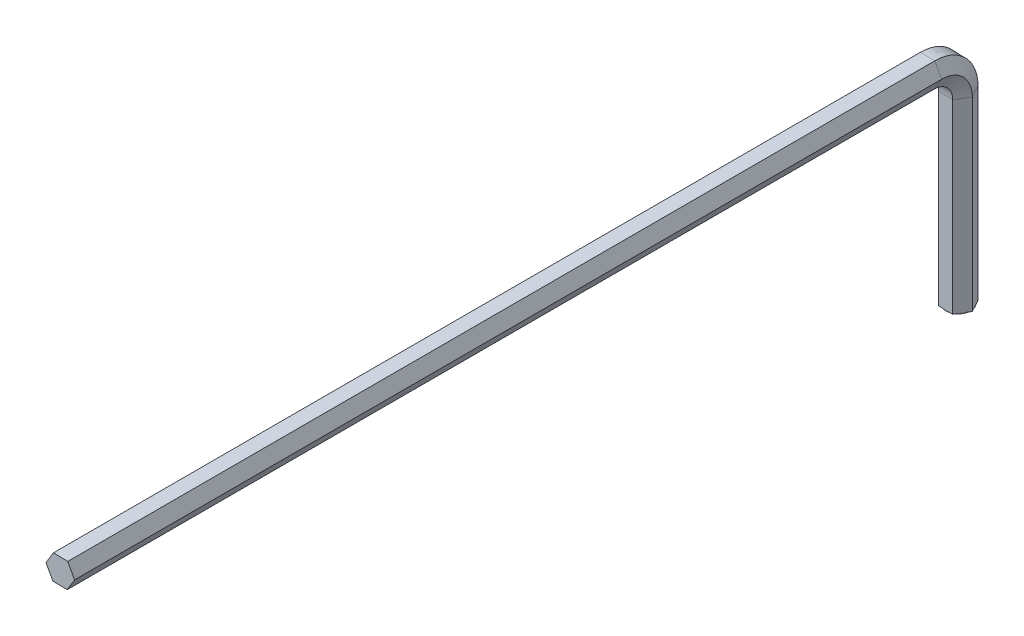
ISO-10303-21;
HEADER;
FILE_DESCRIPTION(('STEP AP214'),'2;1');
FILE_NAME('part.step','',(''),(''),'','','');
FILE_SCHEMA(('AUTOMOTIVE_DESIGN { 1 0 10303 214 1 1 1 1 }'));
ENDSEC;
DATA;
#1=APPLICATION_CONTEXT('core data for automotive mechanical design processes');
#2=APPLICATION_PROTOCOL_DEFINITION('international standard','automotive_design',2000,#1);
#3=PRODUCT_CONTEXT('',#1,'mechanical');
#4=PRODUCT('Part','Part','',(#3));
#5=PRODUCT_RELATED_PRODUCT_CATEGORY('part','',(#4));
#6=PRODUCT_DEFINITION_FORMATION('','',#4);
#7=PRODUCT_DEFINITION_CONTEXT('part definition',#1,'design');
#8=PRODUCT_DEFINITION('design','',#6,#7);
#9=PRODUCT_DEFINITION_SHAPE('','',#8);
#10=(LENGTH_UNIT() NAMED_UNIT(*) SI_UNIT(.MILLI.,.METRE.));
#11=(NAMED_UNIT(*) PLANE_ANGLE_UNIT() SI_UNIT($,.RADIAN.));
#12=(NAMED_UNIT(*) SI_UNIT($,.STERADIAN.) SOLID_ANGLE_UNIT());
#13=UNCERTAINTY_MEASURE_WITH_UNIT(LENGTH_MEASURE(1.E-05),#10,'distance_accuracy_value','');
#14=(GEOMETRIC_REPRESENTATION_CONTEXT(3) GLOBAL_UNCERTAINTY_ASSIGNED_CONTEXT((#13)) GLOBAL_UNIT_ASSIGNED_CONTEXT((#10,
#11,#12)) REPRESENTATION_CONTEXT('',''));
#15=CARTESIAN_POINT('',(0.,0.,0.));
#16=DIRECTION('',(0.,0.,1.));
#17=DIRECTION('',(1.,0.,0.));
#18=AXIS2_PLACEMENT_3D('',#15,#16,#17);
#19=CARTESIAN_POINT('',(0.,0.,0.));
#20=DIRECTION('',(0.,1.,0.));
#21=DIRECTION('',(0.,0.,1.));
#22=AXIS2_PLACEMENT_3D('',#19,#20,#21);
#23=PLANE('',#22);
#24=CARTESIAN_POINT('',(0.,0.,0.));
#25=DIRECTION('',(0.,-1.,0.));
#26=DIRECTION('',(0.,0.,-1.));
#27=AXIS2_PLACEMENT_3D('',#24,#25,#26);
#28=CIRCLE('',#27,2.);
#29=CARTESIAN_POINT('',(0.0427016764946208,0.,-1.9995440897426));
#30=VERTEX_POINT('',#29);
#31=CARTESIAN_POINT('',(1.75300681595143,0.,-0.962791308242771));
#32=VERTEX_POINT('',#31);
#33=EDGE_CURVE('E54',#30,#32,#28,.T.);
#34=ORIENTED_EDGE('',*,*,#33,.F.);
#35=DIRECTION('',(-0.999772044871298,0.,-0.0213508382473104));
#36=VECTOR('',#35,1.);
#37=CARTESIAN_POINT('',(1.19713899496403,0.,-1.97489026532358));
#38=LINE('',#37,#36);
#39=CARTESIAN_POINT('',(1.19713899496403,0.,-1.97489026532358));
#40=VERTEX_POINT('',#39);
#41=EDGE_CURVE('E156',#40,#30,#38,.T.);
#42=ORIENTED_EDGE('',*,*,#41,.F.);
#43=DIRECTION('',(-0.481395654121386,0.,-0.876503407975715));
#44=VECTOR('',#43,1.);
#45=CARTESIAN_POINT('',(2.30887463693882,0.,0.0493076488380349));
#46=LINE('',#45,#44);
#47=EDGE_CURVE('E178',#32,#40,#46,.T.);
#48=ORIENTED_EDGE('',*,*,#47,.F.);
#49=EDGE_LOOP('',(#34,#42,#48));
#50=FACE_BOUND('',#49,.T.);
#51=ADVANCED_FACE('F43',(#50),#23,.F.);
#52=CARTESIAN_POINT('',(1.71030513945681,0.,1.03675278149982));
#53=VERTEX_POINT('',#52);
#54=EDGE_CURVE('E11',#32,#53,#28,.T.);
#55=ORIENTED_EDGE('',*,*,#54,.F.);
#56=CARTESIAN_POINT('',(2.30887463693882,0.,0.0493076488380349));
#57=VERTEX_POINT('',#56);
#58=EDGE_CURVE('E176',#57,#32,#46,.T.);
#59=ORIENTED_EDGE('',*,*,#58,.F.);
#60=DIRECTION('',(0.518376390749912,0.,-0.855152569728405));
#61=VECTOR('',#60,1.);
#62=CARTESIAN_POINT('',(1.11173564197479,0.,2.02419791416162));
#63=LINE('',#62,#61);
#64=EDGE_CURVE('E242',#53,#57,#63,.T.);
#65=ORIENTED_EDGE('',*,*,#64,.F.);
#66=EDGE_LOOP('',(#55,#59,#65));
#67=FACE_BOUND('',#66,.T.);
#68=ADVANCED_FACE('F356',(#67),#23,.F.);
#69=CARTESIAN_POINT('',(-0.0427016764946206,0.,1.9995440897426));
#70=VERTEX_POINT('',#69);
#71=EDGE_CURVE('E52',#53,#70,#28,.T.);
#72=ORIENTED_EDGE('',*,*,#71,.F.);
#73=CARTESIAN_POINT('',(1.11173564197479,0.,2.02419791416162));
#74=VERTEX_POINT('',#73);
#75=EDGE_CURVE('E260',#74,#53,#63,.T.);
#76=ORIENTED_EDGE('',*,*,#75,.F.);
#77=DIRECTION('',(0.999772044871298,0.,0.0213508382473102));
#78=VECTOR('',#77,1.);
#79=CARTESIAN_POINT('',(-1.19713899496403,0.,1.97489026532358));
#80=LINE('',#79,#78);
#81=EDGE_CURVE('E221',#70,#74,#80,.T.);
#82=ORIENTED_EDGE('',*,*,#81,.F.);
#83=EDGE_LOOP('',(#72,#76,#82));
#84=FACE_BOUND('',#83,.T.);
#85=ADVANCED_FACE('F352',(#84),#23,.F.);
#86=CARTESIAN_POINT('',(-1.75300681595143,0.,0.962791308242776));
#87=VERTEX_POINT('',#86);
#88=EDGE_CURVE('E68',#70,#87,#28,.T.);
#89=ORIENTED_EDGE('',*,*,#88,.F.);
#90=CARTESIAN_POINT('',(-1.19713899496403,0.,1.97489026532358));
#91=VERTEX_POINT('',#90);
#92=EDGE_CURVE('E239',#91,#70,#80,.T.);
#93=ORIENTED_EDGE('',*,*,#92,.F.);
#94=DIRECTION('',(0.481395654121388,0.,0.876503407975714));
#95=VECTOR('',#94,1.);
#96=CARTESIAN_POINT('',(-2.30887463693883,0.,-0.0493076488380324));
#97=LINE('',#96,#95);
#98=EDGE_CURVE('E187',#87,#91,#97,.T.);
#99=ORIENTED_EDGE('',*,*,#98,.F.);
#100=EDGE_LOOP('',(#89,#93,#99));
#101=FACE_BOUND('',#100,.T.);
#102=ADVANCED_FACE('F381',(#101),#23,.F.);
#103=CARTESIAN_POINT('',(-1.71030513945681,0.,-1.03675278149982));
#104=VERTEX_POINT('',#103);
#105=EDGE_CURVE('E61',#87,#104,#28,.T.);
#106=ORIENTED_EDGE('',*,*,#105,.F.);
#107=CARTESIAN_POINT('',(-2.30887463693883,0.,-0.0493076488380324));
#108=VERTEX_POINT('',#107);
#109=EDGE_CURVE('E218',#108,#87,#97,.T.);
#110=ORIENTED_EDGE('',*,*,#109,.F.);
#111=DIRECTION('',(-0.518376390749912,0.,0.855152569728405));
#112=VECTOR('',#111,1.);
#113=CARTESIAN_POINT('',(-1.11173564197479,0.,-2.02419791416161));
#114=LINE('',#113,#112);
#115=EDGE_CURVE('E188',#104,#108,#114,.T.);
#116=ORIENTED_EDGE('',*,*,#115,.F.);
#117=EDGE_LOOP('',(#106,#110,#116));
#118=FACE_BOUND('',#117,.T.);
#119=ADVANCED_FACE('F375',(#118),#23,.F.);
#120=EDGE_CURVE('E172',#104,#30,#28,.T.);
#121=ORIENTED_EDGE('',*,*,#120,.F.);
#122=CARTESIAN_POINT('',(-1.11173564197479,0.,-2.02419791416161));
#123=VERTEX_POINT('',#122);
#124=EDGE_CURVE('E174',#123,#104,#114,.T.);
#125=ORIENTED_EDGE('',*,*,#124,.F.);
#126=EDGE_CURVE('E161',#30,#123,#38,.T.);
#127=ORIENTED_EDGE('',*,*,#126,.F.);
#128=EDGE_LOOP('',(#121,#125,#127));
#129=FACE_BOUND('',#128,.T.);
#130=ADVANCED_FACE('F45',(#129),#23,.F.);
#131=CARTESIAN_POINT('',(0.,35.,145.));
#132=DIRECTION('',(0.,0.,1.));
#133=DIRECTION('',(0.,-1.,0.));
#134=AXIS2_PLACEMENT_3D('',#131,#132,#133);
#135=PLANE('',#134);
#136=DIRECTION('',(-0.518376390749912,-0.855152569728405,0.));
#137=VECTOR('',#136,1.);
#138=CARTESIAN_POINT('',(-1.11173564197479,37.0241979141616,145.));
#139=LINE('',#138,#137);
#140=CARTESIAN_POINT('',(-1.11173564197479,37.0241979141616,145.));
#141=VERTEX_POINT('',#140);
#142=CARTESIAN_POINT('',(-2.30887463693883,35.049307648838,145.));
#143=VERTEX_POINT('',#142);
#144=EDGE_CURVE('E208',#141,#143,#139,.T.);
#145=ORIENTED_EDGE('',*,*,#144,.T.);
#146=DIRECTION('',(0.481395654121388,-0.876503407975714,0.));
#147=VECTOR('',#146,1.);
#148=CARTESIAN_POINT('',(-2.30887463693883,35.049307648838,145.));
#149=LINE('',#148,#147);
#150=CARTESIAN_POINT('',(-1.19713899496403,33.0251097346764,145.));
#151=VERTEX_POINT('',#150);
#152=EDGE_CURVE('E214',#143,#151,#149,.T.);
#153=ORIENTED_EDGE('',*,*,#152,.T.);
#154=DIRECTION('',(0.999772044871298,-0.0213508382473102,0.));
#155=VECTOR('',#154,1.);
#156=CARTESIAN_POINT('',(-1.19713899496403,33.0251097346764,145.));
#157=LINE('',#156,#155);
#158=CARTESIAN_POINT('',(1.11173564197479,32.9758020858384,145.));
#159=VERTEX_POINT('',#158);
#160=EDGE_CURVE('E238',#151,#159,#157,.T.);
#161=ORIENTED_EDGE('',*,*,#160,.T.);
#162=DIRECTION('',(0.518376390749912,0.855152569728405,0.));
#163=VECTOR('',#162,1.);
#164=CARTESIAN_POINT('',(1.11173564197479,32.9758020858384,145.));
#165=LINE('',#164,#163);
#166=CARTESIAN_POINT('',(2.30887463693882,34.950692351162,145.));
#167=VERTEX_POINT('',#166);
#168=EDGE_CURVE('E259',#159,#167,#165,.T.);
#169=ORIENTED_EDGE('',*,*,#168,.T.);
#170=DIRECTION('',(-0.481395654121386,0.876503407975715,0.));
#171=VECTOR('',#170,1.);
#172=CARTESIAN_POINT('',(2.30887463693882,34.950692351162,145.));
#173=LINE('',#172,#171);
#174=CARTESIAN_POINT('',(1.19713899496403,36.9748902653236,145.));
#175=VERTEX_POINT('',#174);
#176=EDGE_CURVE('E279',#167,#175,#173,.T.);
#177=ORIENTED_EDGE('',*,*,#176,.T.);
#178=DIRECTION('',(-0.999772044871298,0.0213508382473104,0.));
#179=VECTOR('',#178,1.);
#180=CARTESIAN_POINT('',(1.19713899496403,36.9748902653236,145.));
#181=LINE('',#180,#179);
#182=EDGE_CURVE('E47',#175,#141,#181,.T.);
#183=ORIENTED_EDGE('',*,*,#182,.T.);
#184=EDGE_LOOP('',(#145,#153,#161,#169,#177,#183));
#185=FACE_BOUND('',#184,.T.);
#186=ADVANCED_FACE('F321',(#185),#135,.T.);
#187=CARTESIAN_POINT('',(-1.11173564197479,0.,-2.02419791416161));
#188=DIRECTION('',(-0.855152569728405,0.,-0.518376390749912));
#189=DIRECTION('',(-0.518376390749912,0.,0.855152569728405));
#190=AXIS2_PLACEMENT_3D('',#187,#188,#189);
#191=PLANE('',#190);
#192=DIRECTION('',(0.,1.,0.));
#193=VECTOR('',#192,1.);
#194=CARTESIAN_POINT('',(-2.30887463693883,0.,-0.0493076488380324));
#195=LINE('',#194,#193);
#196=CARTESIAN_POINT('',(-2.30887463693883,30.,-0.0493076488380324));
#197=VERTEX_POINT('',#196);
#198=EDGE_CURVE('E192',#108,#197,#195,.T.);
#199=ORIENTED_EDGE('',*,*,#198,.T.);
#200=DIRECTION('',(-0.518376390749912,0.,0.855152569728405));
#201=VECTOR('',#200,1.);
#202=CARTESIAN_POINT('',(-1.11173564197479,30.,-2.02419791416161));
#203=LINE('',#202,#201);
#204=CARTESIAN_POINT('',(-1.11173564197479,30.,-2.02419791416161));
#205=VERTEX_POINT('',#204);
#206=EDGE_CURVE('E189',#205,#197,#203,.T.);
#207=ORIENTED_EDGE('',*,*,#206,.F.);
#208=DIRECTION('',(0.,1.,0.));
#209=VECTOR('',#208,1.);
#210=CARTESIAN_POINT('',(-1.11173564197479,0.,-2.02419791416161));
#211=LINE('',#210,#209);
#212=EDGE_CURVE('E168',#123,#205,#211,.T.);
#213=ORIENTED_EDGE('',*,*,#212,.F.);
#214=ORIENTED_EDGE('',*,*,#124,.T.);
#215=ORIENTED_EDGE('',*,*,#115,.T.);
#216=EDGE_LOOP('',(#199,#207,#213,#214,#215));
#217=FACE_BOUND('',#216,.T.);
#218=ADVANCED_FACE('F306',(#217),#191,.T.);
#219=CARTESIAN_POINT('',(-2.30887463693883,0.,-0.0493076488380324));
#220=DIRECTION('',(-0.876503407975714,0.,0.481395654121388));
#221=DIRECTION('',(0.481395654121388,0.,0.876503407975714));
#222=AXIS2_PLACEMENT_3D('',#219,#220,#221);
#223=PLANE('',#222);
#224=DIRECTION('',(0.,1.,0.));
#225=VECTOR('',#224,1.);
#226=CARTESIAN_POINT('',(-1.19713899496403,0.,1.97489026532358));
#227=LINE('',#226,#225);
#228=CARTESIAN_POINT('',(-1.19713899496403,30.,1.97489026532358));
#229=VERTEX_POINT('',#228);
#230=EDGE_CURVE('E224',#91,#229,#227,.T.);
#231=ORIENTED_EDGE('',*,*,#230,.T.);
#232=DIRECTION('',(0.481395654121388,0.,0.876503407975714));
#233=VECTOR('',#232,1.);
#234=CARTESIAN_POINT('',(-2.30887463693883,30.,-0.0493076488380324));
#235=LINE('',#234,#233);
#236=EDGE_CURVE('E195',#197,#229,#235,.T.);
#237=ORIENTED_EDGE('',*,*,#236,.F.);
#238=ORIENTED_EDGE('',*,*,#198,.F.);
#239=ORIENTED_EDGE('',*,*,#109,.T.);
#240=ORIENTED_EDGE('',*,*,#98,.T.);
#241=EDGE_LOOP('',(#231,#237,#238,#239,#240));
#242=FACE_BOUND('',#241,.T.);
#243=ADVANCED_FACE('F310',(#242),#223,.T.);
#244=CARTESIAN_POINT('',(-1.19713899496403,0.,1.97489026532358));
#245=DIRECTION('',(-0.0213508382473102,0.,0.999772044871298));
#246=DIRECTION('',(0.999772044871298,0.,0.0213508382473102));
#247=AXIS2_PLACEMENT_3D('',#244,#245,#246);
#248=PLANE('',#247);
#249=DIRECTION('',(0.,1.,0.));
#250=VECTOR('',#249,1.);
#251=CARTESIAN_POINT('',(1.11173564197479,0.,2.02419791416162));
#252=LINE('',#251,#250);
#253=CARTESIAN_POINT('',(1.11173564197479,30.,2.02419791416162));
#254=VERTEX_POINT('',#253);
#255=EDGE_CURVE('E245',#74,#254,#252,.T.);
#256=ORIENTED_EDGE('',*,*,#255,.T.);
#257=DIRECTION('',(0.999772044871298,0.,0.0213508382473102));
#258=VECTOR('',#257,1.);
#259=CARTESIAN_POINT('',(-1.19713899496403,30.,1.97489026532358));
#260=LINE('',#259,#258);
#261=EDGE_CURVE('E227',#229,#254,#260,.T.);
#262=ORIENTED_EDGE('',*,*,#261,.F.);
#263=ORIENTED_EDGE('',*,*,#230,.F.);
#264=ORIENTED_EDGE('',*,*,#92,.T.);
#265=ORIENTED_EDGE('',*,*,#81,.T.);
#266=EDGE_LOOP('',(#256,#262,#263,#264,#265));
#267=FACE_BOUND('',#266,.T.);
#268=ADVANCED_FACE('F348',(#267),#248,.T.);
#269=CARTESIAN_POINT('',(1.11173564197479,0.,2.02419791416162));
#270=DIRECTION('',(0.855152569728405,0.,0.518376390749912));
#271=DIRECTION('',(0.518376390749912,0.,-0.855152569728405));
#272=AXIS2_PLACEMENT_3D('',#269,#270,#271);
#273=PLANE('',#272);
#274=DIRECTION('',(0.,1.,0.));
#275=VECTOR('',#274,1.);
#276=CARTESIAN_POINT('',(2.30887463693882,0.,0.0493076488380349));
#277=LINE('',#276,#275);
#278=CARTESIAN_POINT('',(2.30887463693882,30.,0.0493076488380349));
#279=VERTEX_POINT('',#278);
#280=EDGE_CURVE('E265',#57,#279,#277,.T.);
#281=ORIENTED_EDGE('',*,*,#280,.T.);
#282=DIRECTION('',(0.518376390749912,0.,-0.855152569728405));
#283=VECTOR('',#282,1.);
#284=CARTESIAN_POINT('',(1.11173564197479,30.,2.02419791416162));
#285=LINE('',#284,#283);
#286=EDGE_CURVE('E248',#254,#279,#285,.T.);
#287=ORIENTED_EDGE('',*,*,#286,.F.);
#288=ORIENTED_EDGE('',*,*,#255,.F.);
#289=ORIENTED_EDGE('',*,*,#75,.T.);
#290=ORIENTED_EDGE('',*,*,#64,.T.);
#291=EDGE_LOOP('',(#281,#287,#288,#289,#290));
#292=FACE_BOUND('',#291,.T.);
#293=ADVANCED_FACE('F345',(#292),#273,.T.);
#294=CARTESIAN_POINT('',(2.30887463693882,0.,0.0493076488380349));
#295=DIRECTION('',(0.876503407975715,0.,-0.481395654121386));
#296=DIRECTION('',(-0.481395654121386,0.,-0.876503407975715));
#297=AXIS2_PLACEMENT_3D('',#294,#295,#296);
#298=PLANE('',#297);
#299=DIRECTION('',(0.,1.,0.));
#300=VECTOR('',#299,1.);
#301=CARTESIAN_POINT('',(1.19713899496403,0.,-1.97489026532358));
#302=LINE('',#301,#300);
#303=CARTESIAN_POINT('',(1.19713899496403,30.,-1.97489026532358));
#304=VERTEX_POINT('',#303);
#305=EDGE_CURVE('E164',#40,#304,#302,.T.);
#306=ORIENTED_EDGE('',*,*,#305,.T.);
#307=DIRECTION('',(-0.481395654121386,0.,-0.876503407975715));
#308=VECTOR('',#307,1.);
#309=CARTESIAN_POINT('',(2.30887463693882,30.,0.0493076488380349));
#310=LINE('',#309,#308);
#311=EDGE_CURVE('E268',#279,#304,#310,.T.);
#312=ORIENTED_EDGE('',*,*,#311,.F.);
#313=ORIENTED_EDGE('',*,*,#280,.F.);
#314=ORIENTED_EDGE('',*,*,#58,.T.);
#315=ORIENTED_EDGE('',*,*,#47,.T.);
#316=EDGE_LOOP('',(#306,#312,#313,#314,#315));
#317=FACE_BOUND('',#316,.T.);
#318=ADVANCED_FACE('F358',(#317),#298,.T.);
#319=CARTESIAN_POINT('',(1.19713899496403,0.,-1.97489026532358));
#320=DIRECTION('',(0.0213508382473104,0.,-0.999772044871298));
#321=DIRECTION('',(-0.999772044871298,0.,-0.0213508382473104));
#322=AXIS2_PLACEMENT_3D('',#319,#320,#321);
#323=PLANE('',#322);
#324=DIRECTION('',(-0.999772044871298,0.,-0.0213508382473104));
#325=VECTOR('',#324,1.);
#326=CARTESIAN_POINT('',(1.19713899496403,30.,-1.97489026532358));
#327=LINE('',#326,#325);
#328=EDGE_CURVE('E207',#304,#205,#327,.T.);
#329=ORIENTED_EDGE('',*,*,#328,.F.);
#330=ORIENTED_EDGE('',*,*,#305,.F.);
#331=ORIENTED_EDGE('',*,*,#41,.T.);
#332=ORIENTED_EDGE('',*,*,#126,.T.);
#333=ORIENTED_EDGE('',*,*,#212,.T.);
#334=EDGE_LOOP('',(#329,#330,#331,#332,#333));
#335=FACE_BOUND('',#334,.T.);
#336=ADVANCED_FACE('F159',(#335),#323,.T.);
#337=CARTESIAN_POINT('',(-1.11173564197479,30.,5.));
#338=DIRECTION('',(1.,0.,0.));
#339=DIRECTION('',(0.,0.,-1.));
#340=AXIS2_PLACEMENT_3D('',#337,#338,#339);
#341=CONICAL_SURFACE('',#340,7.02419791416161,1.02584509045698);
#342=CARTESIAN_POINT('',(-2.30887463693882,30.,5.));
#343=DIRECTION('',(1.,0.,0.));
#344=DIRECTION('',(0.,0.,-1.));
#345=AXIS2_PLACEMENT_3D('',#342,#343,#344);
#346=CIRCLE('',#345,5.04930764883803);
#347=CARTESIAN_POINT('',(-2.30887463693882,35.049307648838,5.));
#348=VERTEX_POINT('',#347);
#349=EDGE_CURVE('E200',#197,#348,#346,.T.);
#350=ORIENTED_EDGE('',*,*,#349,.T.);
#351=DIRECTION('',(-0.518376390749912,-0.855152569728405,0.));
#352=VECTOR('',#351,1.);
#353=CARTESIAN_POINT('',(-1.11173564197479,37.0241979141616,5.));
#354=LINE('',#353,#352);
#355=CARTESIAN_POINT('',(-1.11173564197479,37.0241979141616,5.));
#356=VERTEX_POINT('',#355);
#357=EDGE_CURVE('E197',#356,#348,#354,.T.);
#358=ORIENTED_EDGE('',*,*,#357,.F.);
#359=CARTESIAN_POINT('',(-1.11173564197479,30.,5.));
#360=DIRECTION('',(1.,0.,0.));
#361=DIRECTION('',(0.,0.,-1.));
#362=AXIS2_PLACEMENT_3D('',#359,#360,#361);
#363=CIRCLE('',#362,7.02419791416161);
#364=EDGE_CURVE('E201',#205,#356,#363,.T.);
#365=ORIENTED_EDGE('',*,*,#364,.F.);
#366=ORIENTED_EDGE('',*,*,#206,.T.);
#367=EDGE_LOOP('',(#350,#358,#365,#366));
#368=FACE_BOUND('',#367,.T.);
#369=ADVANCED_FACE('F301',(#368),#341,.T.);
#370=CARTESIAN_POINT('',(-2.30887463693882,30.,5.));
#371=DIRECTION('',(-1.,0.,0.));
#372=DIRECTION('',(0.,0.,1.));
#373=AXIS2_PLACEMENT_3D('',#370,#371,#372);
#374=CONICAL_SURFACE('',#373,5.04930764883803,1.06855001193621);
#375=CARTESIAN_POINT('',(-1.19713899496402,30.,5.));
#376=DIRECTION('',(1.,0.,0.));
#377=DIRECTION('',(0.,0.,-1.));
#378=AXIS2_PLACEMENT_3D('',#375,#376,#377);
#379=CIRCLE('',#378,3.02510973467642);
#380=CARTESIAN_POINT('',(-1.19713899496402,33.0251097346764,5.));
#381=VERTEX_POINT('',#380);
#382=EDGE_CURVE('E230',#229,#381,#379,.T.);
#383=ORIENTED_EDGE('',*,*,#382,.T.);
#384=DIRECTION('',(0.481395654121388,-0.876503407975714,0.));
#385=VECTOR('',#384,1.);
#386=CARTESIAN_POINT('',(-2.30887463693882,35.049307648838,5.));
#387=LINE('',#386,#385);
#388=EDGE_CURVE('E204',#348,#381,#387,.T.);
#389=ORIENTED_EDGE('',*,*,#388,.F.);
#390=ORIENTED_EDGE('',*,*,#349,.F.);
#391=ORIENTED_EDGE('',*,*,#236,.T.);
#392=EDGE_LOOP('',(#383,#389,#390,#391));
#393=FACE_BOUND('',#392,.T.);
#394=ADVANCED_FACE('F313',(#393),#374,.F.);
#395=CARTESIAN_POINT('',(-1.19713899496402,30.,5.));
#396=DIRECTION('',(-1.,0.,0.));
#397=DIRECTION('',(0.,0.,1.));
#398=AXIS2_PLACEMENT_3D('',#395,#396,#397);
#399=CONICAL_SURFACE('',#398,3.02510973467642,0.0213524607396136);
#400=CARTESIAN_POINT('',(1.11173564197479,30.,5.));
#401=DIRECTION('',(1.,0.,0.));
#402=DIRECTION('',(0.,0.,-1.));
#403=AXIS2_PLACEMENT_3D('',#400,#401,#402);
#404=CIRCLE('',#403,2.97580208583838);
#405=CARTESIAN_POINT('',(1.11173564197479,32.9758020858384,5.));
#406=VERTEX_POINT('',#405);
#407=EDGE_CURVE('E251',#254,#406,#404,.T.);
#408=ORIENTED_EDGE('',*,*,#407,.T.);
#409=DIRECTION('',(0.999772044871298,-0.0213508382473102,0.));
#410=VECTOR('',#409,1.);
#411=CARTESIAN_POINT('',(-1.19713899496402,33.0251097346764,5.));
#412=LINE('',#411,#410);
#413=EDGE_CURVE('E233',#381,#406,#412,.T.);
#414=ORIENTED_EDGE('',*,*,#413,.F.);
#415=ORIENTED_EDGE('',*,*,#382,.F.);
#416=ORIENTED_EDGE('',*,*,#261,.T.);
#417=EDGE_LOOP('',(#408,#414,#415,#416));
#418=FACE_BOUND('',#417,.T.);
#419=ADVANCED_FACE('F341',(#418),#399,.F.);
#420=CARTESIAN_POINT('',(1.11173564197479,30.,5.));
#421=DIRECTION('',(1.,0.,0.));
#422=DIRECTION('',(0.,0.,-1.));
#423=AXIS2_PLACEMENT_3D('',#420,#421,#422);
#424=CONICAL_SURFACE('',#423,2.97580208583838,1.02584509045698);
#425=CARTESIAN_POINT('',(2.30887463693883,30.,5.));
#426=DIRECTION('',(1.,0.,0.));
#427=DIRECTION('',(0.,0.,-1.));
#428=AXIS2_PLACEMENT_3D('',#425,#426,#427);
#429=CIRCLE('',#428,4.95069235116197);
#430=CARTESIAN_POINT('',(2.30887463693883,34.950692351162,5.));
#431=VERTEX_POINT('',#430);
#432=EDGE_CURVE('E271',#279,#431,#429,.T.);
#433=ORIENTED_EDGE('',*,*,#432,.T.);
#434=DIRECTION('',(0.518376390749912,0.855152569728405,0.));
#435=VECTOR('',#434,1.);
#436=CARTESIAN_POINT('',(1.11173564197479,32.9758020858384,5.));
#437=LINE('',#436,#435);
#438=EDGE_CURVE('E254',#406,#431,#437,.T.);
#439=ORIENTED_EDGE('',*,*,#438,.F.);
#440=ORIENTED_EDGE('',*,*,#407,.F.);
#441=ORIENTED_EDGE('',*,*,#286,.T.);
#442=EDGE_LOOP('',(#433,#439,#440,#441));
#443=FACE_BOUND('',#442,.T.);
#444=ADVANCED_FACE('F332',(#443),#424,.F.);
#445=CARTESIAN_POINT('',(2.30887463693883,30.,5.));
#446=DIRECTION('',(-1.,0.,0.));
#447=DIRECTION('',(0.,0.,1.));
#448=AXIS2_PLACEMENT_3D('',#445,#446,#447);
#449=CONICAL_SURFACE('',#448,4.95069235116197,1.06855001193621);
#450=CARTESIAN_POINT('',(1.19713899496404,30.,5.));
#451=DIRECTION('',(1.,0.,0.));
#452=DIRECTION('',(0.,0.,-1.));
#453=AXIS2_PLACEMENT_3D('',#450,#451,#452);
#454=CIRCLE('',#453,6.97489026532358);
#455=CARTESIAN_POINT('',(1.19713899496404,36.9748902653236,5.));
#456=VERTEX_POINT('',#455);
#457=EDGE_CURVE('E286',#304,#456,#454,.T.);
#458=ORIENTED_EDGE('',*,*,#457,.T.);
#459=DIRECTION('',(-0.481395654121386,0.876503407975715,0.));
#460=VECTOR('',#459,1.);
#461=CARTESIAN_POINT('',(2.30887463693883,34.950692351162,5.));
#462=LINE('',#461,#460);
#463=EDGE_CURVE('E274',#431,#456,#462,.T.);
#464=ORIENTED_EDGE('',*,*,#463,.F.);
#465=ORIENTED_EDGE('',*,*,#432,.F.);
#466=ORIENTED_EDGE('',*,*,#311,.T.);
#467=EDGE_LOOP('',(#458,#464,#465,#466));
#468=FACE_BOUND('',#467,.T.);
#469=ADVANCED_FACE('F328',(#468),#449,.T.);
#470=CARTESIAN_POINT('',(1.19713899496404,30.,5.));
#471=DIRECTION('',(-1.,0.,0.));
#472=DIRECTION('',(0.,0.,1.));
#473=AXIS2_PLACEMENT_3D('',#470,#471,#472);
#474=CONICAL_SURFACE('',#473,6.97489026532358,0.0213524607396139);
#475=DIRECTION('',(-0.999772044871298,0.0213508382473104,0.));
#476=VECTOR('',#475,1.);
#477=CARTESIAN_POINT('',(1.19713899496404,36.9748902653236,5.));
#478=LINE('',#477,#476);
#479=EDGE_CURVE('E217',#456,#356,#478,.T.);
#480=ORIENTED_EDGE('',*,*,#479,.F.);
#481=ORIENTED_EDGE('',*,*,#457,.F.);
#482=ORIENTED_EDGE('',*,*,#328,.T.);
#483=ORIENTED_EDGE('',*,*,#364,.T.);
#484=EDGE_LOOP('',(#480,#481,#482,#483));
#485=FACE_BOUND('',#484,.T.);
#486=ADVANCED_FACE('F303',(#485),#474,.T.);
#487=CARTESIAN_POINT('',(-1.11173564197479,37.0241979141616,5.));
#488=DIRECTION('',(-0.855152569728405,0.518376390749912,0.));
#489=DIRECTION('',(-0.518376390749912,-0.855152569728405,0.));
#490=AXIS2_PLACEMENT_3D('',#487,#488,#489);
#491=PLANE('',#490);
#492=DIRECTION('',(0.,0.,1.));
#493=VECTOR('',#492,1.);
#494=CARTESIAN_POINT('',(-2.30887463693883,35.049307648838,5.));
#495=LINE('',#494,#493);
#496=EDGE_CURVE('E210',#348,#143,#495,.T.);
#497=ORIENTED_EDGE('',*,*,#496,.T.);
#498=ORIENTED_EDGE('',*,*,#144,.F.);
#499=DIRECTION('',(0.,0.,1.));
#500=VECTOR('',#499,1.);
#501=CARTESIAN_POINT('',(-1.11173564197479,37.0241979141616,5.));
#502=LINE('',#501,#500);
#503=EDGE_CURVE('E211',#356,#141,#502,.T.);
#504=ORIENTED_EDGE('',*,*,#503,.F.);
#505=ORIENTED_EDGE('',*,*,#357,.T.);
#506=EDGE_LOOP('',(#497,#498,#504,#505));
#507=FACE_BOUND('',#506,.T.);
#508=ADVANCED_FACE('F319',(#507),#491,.T.);
#509=CARTESIAN_POINT('',(-2.30887463693883,35.049307648838,5.));
#510=DIRECTION('',(-0.876503407975714,-0.481395654121388,0.));
#511=DIRECTION('',(0.481395654121388,-0.876503407975714,0.));
#512=AXIS2_PLACEMENT_3D('',#509,#510,#511);
#513=PLANE('',#512);
#514=DIRECTION('',(0.,0.,1.));
#515=VECTOR('',#514,1.);
#516=CARTESIAN_POINT('',(-1.19713899496403,33.0251097346764,5.));
#517=LINE('',#516,#515);
#518=EDGE_CURVE('E235',#381,#151,#517,.T.);
#519=ORIENTED_EDGE('',*,*,#518,.T.);
#520=ORIENTED_EDGE('',*,*,#152,.F.);
#521=ORIENTED_EDGE('',*,*,#496,.F.);
#522=ORIENTED_EDGE('',*,*,#388,.T.);
#523=EDGE_LOOP('',(#519,#520,#521,#522));
#524=FACE_BOUND('',#523,.T.);
#525=ADVANCED_FACE('F316',(#524),#513,.T.);
#526=CARTESIAN_POINT('',(-1.19713899496403,33.0251097346764,5.));
#527=DIRECTION('',(-0.0213508382473102,-0.999772044871298,0.));
#528=DIRECTION('',(0.999772044871298,-0.0213508382473102,0.));
#529=AXIS2_PLACEMENT_3D('',#526,#527,#528);
#530=PLANE('',#529);
#531=DIRECTION('',(0.,0.,1.));
#532=VECTOR('',#531,1.);
#533=CARTESIAN_POINT('',(1.11173564197479,32.9758020858384,5.));
#534=LINE('',#533,#532);
#535=EDGE_CURVE('E256',#406,#159,#534,.T.);
#536=ORIENTED_EDGE('',*,*,#535,.T.);
#537=ORIENTED_EDGE('',*,*,#160,.F.);
#538=ORIENTED_EDGE('',*,*,#518,.F.);
#539=ORIENTED_EDGE('',*,*,#413,.T.);
#540=EDGE_LOOP('',(#536,#537,#538,#539));
#541=FACE_BOUND('',#540,.T.);
#542=ADVANCED_FACE('F338',(#541),#530,.T.);
#543=CARTESIAN_POINT('',(1.11173564197479,32.9758020858384,5.));
#544=DIRECTION('',(0.855152569728405,-0.518376390749912,0.));
#545=DIRECTION('',(0.518376390749912,0.855152569728405,0.));
#546=AXIS2_PLACEMENT_3D('',#543,#544,#545);
#547=PLANE('',#546);
#548=DIRECTION('',(0.,0.,1.));
#549=VECTOR('',#548,1.);
#550=CARTESIAN_POINT('',(2.30887463693882,34.950692351162,5.));
#551=LINE('',#550,#549);
#552=EDGE_CURVE('E276',#431,#167,#551,.T.);
#553=ORIENTED_EDGE('',*,*,#552,.T.);
#554=ORIENTED_EDGE('',*,*,#168,.F.);
#555=ORIENTED_EDGE('',*,*,#535,.F.);
#556=ORIENTED_EDGE('',*,*,#438,.T.);
#557=EDGE_LOOP('',(#553,#554,#555,#556));
#558=FACE_BOUND('',#557,.T.);
#559=ADVANCED_FACE('F335',(#558),#547,.T.);
#560=CARTESIAN_POINT('',(2.30887463693882,34.950692351162,5.));
#561=DIRECTION('',(0.876503407975715,0.481395654121386,0.));
#562=DIRECTION('',(-0.481395654121386,0.876503407975715,0.));
#563=AXIS2_PLACEMENT_3D('',#560,#561,#562);
#564=PLANE('',#563);
#565=DIRECTION('',(0.,0.,1.));
#566=VECTOR('',#565,1.);
#567=CARTESIAN_POINT('',(1.19713899496403,36.9748902653236,5.));
#568=LINE('',#567,#566);
#569=EDGE_CURVE('E183',#456,#175,#568,.T.);
#570=ORIENTED_EDGE('',*,*,#569,.T.);
#571=ORIENTED_EDGE('',*,*,#176,.F.);
#572=ORIENTED_EDGE('',*,*,#552,.F.);
#573=ORIENTED_EDGE('',*,*,#463,.T.);
#574=EDGE_LOOP('',(#570,#571,#572,#573));
#575=FACE_BOUND('',#574,.T.);
#576=ADVANCED_FACE('F325',(#575),#564,.T.);
#577=CARTESIAN_POINT('',(1.19713899496403,36.9748902653236,5.));
#578=DIRECTION('',(0.0213508382473103,0.999772044871298,0.));
#579=DIRECTION('',(-0.999772044871298,0.0213508382473104,0.));
#580=AXIS2_PLACEMENT_3D('',#577,#578,#579);
#581=PLANE('',#580);
#582=ORIENTED_EDGE('',*,*,#182,.F.);
#583=ORIENTED_EDGE('',*,*,#569,.F.);
#584=ORIENTED_EDGE('',*,*,#479,.T.);
#585=ORIENTED_EDGE('',*,*,#503,.T.);
#586=EDGE_LOOP('',(#582,#583,#584,#585));
#587=FACE_BOUND('',#586,.T.);
#588=ADVANCED_FACE('F298',(#587),#581,.T.);
#589=CARTESIAN_POINT('',(0.,-0.1,0.));
#590=DIRECTION('',(0.,1.,0.));
#591=DIRECTION('',(0.,0.,1.));
#592=AXIS2_PLACEMENT_3D('',#589,#590,#591);
#593=CYLINDRICAL_SURFACE('',#592,2.);
#594=CARTESIAN_POINT('',(0.,-0.1,0.));
#595=DIRECTION('',(0.,-1.,0.));
#596=DIRECTION('',(0.,0.,-1.));
#597=AXIS2_PLACEMENT_3D('',#594,#595,#596);
#598=CIRCLE('',#597,2.);
#599=CARTESIAN_POINT('',(0.,-0.1,-2.));
#600=VERTEX_POINT('',#599);
#601=EDGE_CURVE('E181',#600,#600,#598,.T.);
#602=ORIENTED_EDGE('',*,*,#601,.F.);
#603=EDGE_LOOP('',(#602));
#604=FACE_BOUND('',#603,.T.);
#605=ORIENTED_EDGE('',*,*,#33,.T.);
#606=ORIENTED_EDGE('',*,*,#54,.T.);
#607=ORIENTED_EDGE('',*,*,#71,.T.);
#608=ORIENTED_EDGE('',*,*,#88,.T.);
#609=ORIENTED_EDGE('',*,*,#105,.T.);
#610=ORIENTED_EDGE('',*,*,#120,.T.);
#611=EDGE_LOOP('',(#605,#606,#607,#608,#609,#610));
#612=FACE_BOUND('',#611,.T.);
#613=ADVANCED_FACE('F182',(#604,#612),#593,.T.);
#614=CARTESIAN_POINT('',(0.,-0.1,0.));
#615=DIRECTION('',(0.,-1.,0.));
#616=DIRECTION('',(0.,0.,-1.));
#617=AXIS2_PLACEMENT_3D('',#614,#615,#616);
#618=PLANE('',#617);
#619=ORIENTED_EDGE('',*,*,#601,.T.);
#620=EDGE_LOOP('',(#619));
#621=FACE_BOUND('',#620,.T.);
#622=ADVANCED_FACE('F383',(#621),#618,.T.);
#623=CLOSED_SHELL('',(#51,#68,#85,#102,#119,#130,#186,#218,#243,#268,#293,#318,#336,#369,#394,
#419,#444,#469,#486,#508,#525,#542,#559,#576,#588,#613,#622));
#624=MANIFOLD_SOLID_BREP('B2',#623);
#625=ADVANCED_BREP_SHAPE_REPRESENTATION('',(#18,#624),#14);
#626=SHAPE_DEFINITION_REPRESENTATION(#9,#625);
ENDSEC;
END-ISO-10303-21;
